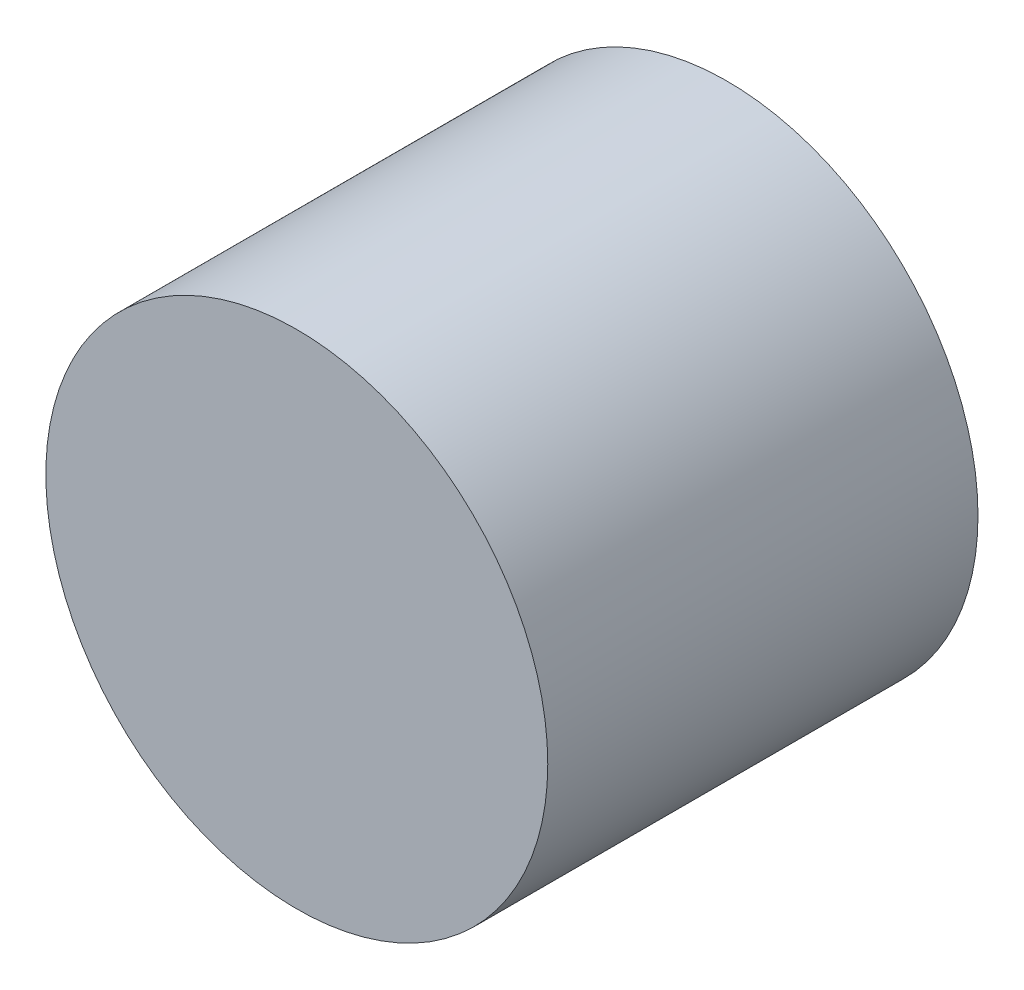
ISO-10303-21;
HEADER;
FILE_DESCRIPTION(('STEP AP214'),'2;1');
FILE_NAME('part.step','',(''),(''),'','','');
FILE_SCHEMA(('AUTOMOTIVE_DESIGN { 1 0 10303 214 1 1 1 1 }'));
ENDSEC;
DATA;
#1=APPLICATION_CONTEXT('core data for automotive mechanical design processes');
#2=APPLICATION_PROTOCOL_DEFINITION('international standard','automotive_design',2000,#1);
#3=PRODUCT_CONTEXT('',#1,'mechanical');
#4=PRODUCT('Part','Part','',(#3));
#5=PRODUCT_RELATED_PRODUCT_CATEGORY('part','',(#4));
#6=PRODUCT_DEFINITION_FORMATION('','',#4);
#7=PRODUCT_DEFINITION_CONTEXT('part definition',#1,'design');
#8=PRODUCT_DEFINITION('design','',#6,#7);
#9=PRODUCT_DEFINITION_SHAPE('','',#8);
#10=(LENGTH_UNIT() NAMED_UNIT(*) SI_UNIT(.MILLI.,.METRE.));
#11=(NAMED_UNIT(*) PLANE_ANGLE_UNIT() SI_UNIT($,.RADIAN.));
#12=(NAMED_UNIT(*) SI_UNIT($,.STERADIAN.) SOLID_ANGLE_UNIT());
#13=UNCERTAINTY_MEASURE_WITH_UNIT(LENGTH_MEASURE(1.E-05),#10,'distance_accuracy_value','');
#14=(GEOMETRIC_REPRESENTATION_CONTEXT(3) GLOBAL_UNCERTAINTY_ASSIGNED_CONTEXT((#13)) GLOBAL_UNIT_ASSIGNED_CONTEXT((#10,
#11,#12)) REPRESENTATION_CONTEXT('',''));
#15=CARTESIAN_POINT('',(0.,0.,0.));
#16=DIRECTION('',(0.,0.,1.));
#17=DIRECTION('',(1.,0.,0.));
#18=AXIS2_PLACEMENT_3D('',#15,#16,#17);
#19=CARTESIAN_POINT('',(0.,0.,38.1));
#20=DIRECTION('',(0.,0.,-1.));
#21=DIRECTION('',(-1.,0.,0.));
#22=AXIS2_PLACEMENT_3D('',#19,#20,#21);
#23=CYLINDRICAL_SURFACE('',#22,22.225);
#24=CARTESIAN_POINT('',(0.,0.,38.1));
#25=DIRECTION('',(0.,0.,1.));
#26=DIRECTION('',(1.,0.,0.));
#27=AXIS2_PLACEMENT_3D('',#24,#25,#26);
#28=CIRCLE('',#27,22.225);
#29=CARTESIAN_POINT('',(22.225,0.,38.1));
#30=VERTEX_POINT('',#29);
#31=EDGE_CURVE('E10',#30,#30,#28,.T.);
#32=ORIENTED_EDGE('',*,*,#31,.F.);
#33=EDGE_LOOP('',(#32));
#34=FACE_BOUND('',#33,.T.);
#35=CARTESIAN_POINT('',(0.,0.,0.));
#36=DIRECTION('',(0.,0.,1.));
#37=DIRECTION('',(1.,0.,0.));
#38=AXIS2_PLACEMENT_3D('',#35,#36,#37);
#39=CIRCLE('',#38,22.225);
#40=CARTESIAN_POINT('',(22.225,0.,0.));
#41=VERTEX_POINT('',#40);
#42=EDGE_CURVE('E34',#41,#41,#39,.T.);
#43=ORIENTED_EDGE('',*,*,#42,.T.);
#44=EDGE_LOOP('',(#43));
#45=FACE_BOUND('',#44,.T.);
#46=ADVANCED_FACE('F31',(#34,#45),#23,.T.);
#47=CARTESIAN_POINT('',(0.,0.,38.1));
#48=DIRECTION('',(0.,0.,1.));
#49=DIRECTION('',(1.,0.,0.));
#50=AXIS2_PLACEMENT_3D('',#47,#48,#49);
#51=PLANE('',#50);
#52=ORIENTED_EDGE('',*,*,#31,.T.);
#53=EDGE_LOOP('',(#52));
#54=FACE_BOUND('',#53,.T.);
#55=ADVANCED_FACE('F46',(#54),#51,.T.);
#56=CARTESIAN_POINT('',(0.,0.,0.));
#57=DIRECTION('',(0.,0.,1.));
#58=DIRECTION('',(1.,0.,0.));
#59=AXIS2_PLACEMENT_3D('',#56,#57,#58);
#60=PLANE('',#59);
#61=ORIENTED_EDGE('',*,*,#42,.F.);
#62=EDGE_LOOP('',(#61));
#63=FACE_BOUND('',#62,.T.);
#64=ADVANCED_FACE('F44',(#63),#60,.F.);
#65=CLOSED_SHELL('',(#46,#55,#64));
#66=MANIFOLD_SOLID_BREP('B2',#65);
#67=ADVANCED_BREP_SHAPE_REPRESENTATION('',(#18,#66),#14);
#68=SHAPE_DEFINITION_REPRESENTATION(#9,#67);
ENDSEC;
END-ISO-10303-21;
